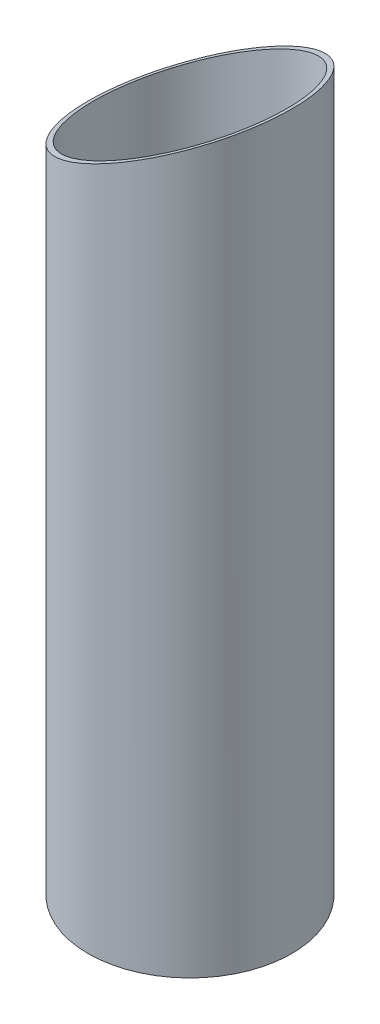
ISO-10303-21;
HEADER;
FILE_DESCRIPTION(('STEP AP214'),'2;1');
FILE_NAME('part.step','',(''),(''),'','','');
FILE_SCHEMA(('AUTOMOTIVE_DESIGN { 1 0 10303 214 1 1 1 1 }'));
ENDSEC;
DATA;
#1=APPLICATION_CONTEXT('core data for automotive mechanical design processes');
#2=APPLICATION_PROTOCOL_DEFINITION('international standard','automotive_design',2000,#1);
#3=PRODUCT_CONTEXT('',#1,'mechanical');
#4=PRODUCT('Part','Part','',(#3));
#5=PRODUCT_RELATED_PRODUCT_CATEGORY('part','',(#4));
#6=PRODUCT_DEFINITION_FORMATION('','',#4);
#7=PRODUCT_DEFINITION_CONTEXT('part definition',#1,'design');
#8=PRODUCT_DEFINITION('design','',#6,#7);
#9=PRODUCT_DEFINITION_SHAPE('','',#8);
#10=(LENGTH_UNIT() NAMED_UNIT(*) SI_UNIT(.MILLI.,.METRE.));
#11=(NAMED_UNIT(*) PLANE_ANGLE_UNIT() SI_UNIT($,.RADIAN.));
#12=(NAMED_UNIT(*) SI_UNIT($,.STERADIAN.) SOLID_ANGLE_UNIT());
#13=UNCERTAINTY_MEASURE_WITH_UNIT(LENGTH_MEASURE(1.E-05),#10,'distance_accuracy_value','');
#14=(GEOMETRIC_REPRESENTATION_CONTEXT(3) GLOBAL_UNCERTAINTY_ASSIGNED_CONTEXT((#13)) GLOBAL_UNIT_ASSIGNED_CONTEXT((#10,
#11,#12)) REPRESENTATION_CONTEXT('',''));
#15=CARTESIAN_POINT('',(0.,0.,0.));
#16=DIRECTION('',(0.,0.,1.));
#17=DIRECTION('',(1.,0.,0.));
#18=AXIS2_PLACEMENT_3D('',#15,#16,#17);
#19=CARTESIAN_POINT('',(0.,300.,0.));
#20=DIRECTION('',(0.,-1.,0.));
#21=DIRECTION('',(0.,0.,-1.));
#22=AXIS2_PLACEMENT_3D('',#19,#20,#21);
#23=CYLINDRICAL_SURFACE('',#22,40.);
#24=CARTESIAN_POINT('',(0.,0.,0.));
#25=DIRECTION('',(0.,1.,0.));
#26=DIRECTION('',(0.,0.,1.));
#27=AXIS2_PLACEMENT_3D('',#24,#25,#26);
#28=CIRCLE('',#27,40.);
#29=CARTESIAN_POINT('',(0.,0.,40.));
#30=VERTEX_POINT('',#29);
#31=EDGE_CURVE('E10',#30,#30,#28,.T.);
#32=ORIENTED_EDGE('',*,*,#31,.T.);
#33=EDGE_LOOP('',(#32));
#34=FACE_BOUND('',#33,.T.);
#35=CARTESIAN_POINT('',(0.,268.6523063262,0.));
#36=DIRECTION('',(-0.422618261740701,0.906307787036649,0.));
#37=DIRECTION('',(-0.906307787036649,-0.422618261740701,0.));
#38=AXIS2_PLACEMENT_3D('',#35,#36,#37);
#39=ELLIPSE('',#38,44.1351167584997,40.);
#40=CARTESIAN_POINT('',(-40.,250.,0.));
#41=VERTEX_POINT('',#40);
#42=EDGE_CURVE('E42',#41,#41,#39,.T.);
#43=ORIENTED_EDGE('',*,*,#42,.F.);
#44=EDGE_LOOP('',(#43));
#45=FACE_BOUND('',#44,.T.);
#46=ADVANCED_FACE('F31',(#34,#45),#23,.T.);
#47=CARTESIAN_POINT('',(0.,300.,0.));
#48=DIRECTION('',(0.,-1.,0.));
#49=DIRECTION('',(0.,0.,-1.));
#50=AXIS2_PLACEMENT_3D('',#47,#48,#49);
#51=CYLINDRICAL_SURFACE('',#50,38.);
#52=CARTESIAN_POINT('',(0.,0.,0.));
#53=DIRECTION('',(0.,1.,0.));
#54=DIRECTION('',(0.,0.,1.));
#55=AXIS2_PLACEMENT_3D('',#52,#53,#54);
#56=CIRCLE('',#55,38.);
#57=CARTESIAN_POINT('',(0.,0.,38.));
#58=VERTEX_POINT('',#57);
#59=EDGE_CURVE('E38',#58,#58,#56,.T.);
#60=ORIENTED_EDGE('',*,*,#59,.F.);
#61=EDGE_LOOP('',(#60));
#62=FACE_BOUND('',#61,.T.);
#63=CARTESIAN_POINT('',(0.,268.6523063262,0.));
#64=DIRECTION('',(-0.422618261740701,0.906307787036649,0.));
#65=DIRECTION('',(-0.906307787036649,-0.422618261740701,0.));
#66=AXIS2_PLACEMENT_3D('',#63,#64,#65);
#67=ELLIPSE('',#66,41.9283609205747,38.);
#68=CARTESIAN_POINT('',(-38.,250.93261531631,0.));
#69=VERTEX_POINT('',#68);
#70=EDGE_CURVE('E34',#69,#69,#67,.T.);
#71=ORIENTED_EDGE('',*,*,#70,.T.);
#72=EDGE_LOOP('',(#71));
#73=FACE_BOUND('',#72,.T.);
#74=ADVANCED_FACE('F51',(#62,#73),#51,.F.);
#75=CARTESIAN_POINT('',(0.,0.,0.));
#76=DIRECTION('',(0.,1.,0.));
#77=DIRECTION('',(0.,0.,1.));
#78=AXIS2_PLACEMENT_3D('',#75,#76,#77);
#79=PLANE('',#78);
#80=ORIENTED_EDGE('',*,*,#31,.F.);
#81=EDGE_LOOP('',(#80));
#82=FACE_BOUND('',#81,.T.);
#83=ORIENTED_EDGE('',*,*,#59,.T.);
#84=EDGE_LOOP('',(#83));
#85=FACE_BOUND('',#84,.T.);
#86=ADVANCED_FACE('F55',(#82,#85),#79,.F.);
#87=CARTESIAN_POINT('',(-60.7130649010973,240.341339212757,50.));
#88=DIRECTION('',(-0.422618261740701,0.906307787036649,0.));
#89=DIRECTION('',(-0.906307787036649,-0.422618261740701,0.));
#90=AXIS2_PLACEMENT_3D('',#87,#88,#89);
#91=PLANE('',#90);
#92=ORIENTED_EDGE('',*,*,#70,.F.);
#93=EDGE_LOOP('',(#92));
#94=FACE_BOUND('',#93,.T.);
#95=ORIENTED_EDGE('',*,*,#42,.T.);
#96=EDGE_LOOP('',(#95));
#97=FACE_BOUND('',#96,.T.);
#98=ADVANCED_FACE('F53',(#94,#97),#91,.T.);
#99=CLOSED_SHELL('',(#46,#74,#86,#98));
#100=MANIFOLD_SOLID_BREP('B2',#99);
#101=ADVANCED_BREP_SHAPE_REPRESENTATION('',(#18,#100),#14);
#102=SHAPE_DEFINITION_REPRESENTATION(#9,#101);
ENDSEC;
END-ISO-10303-21;
